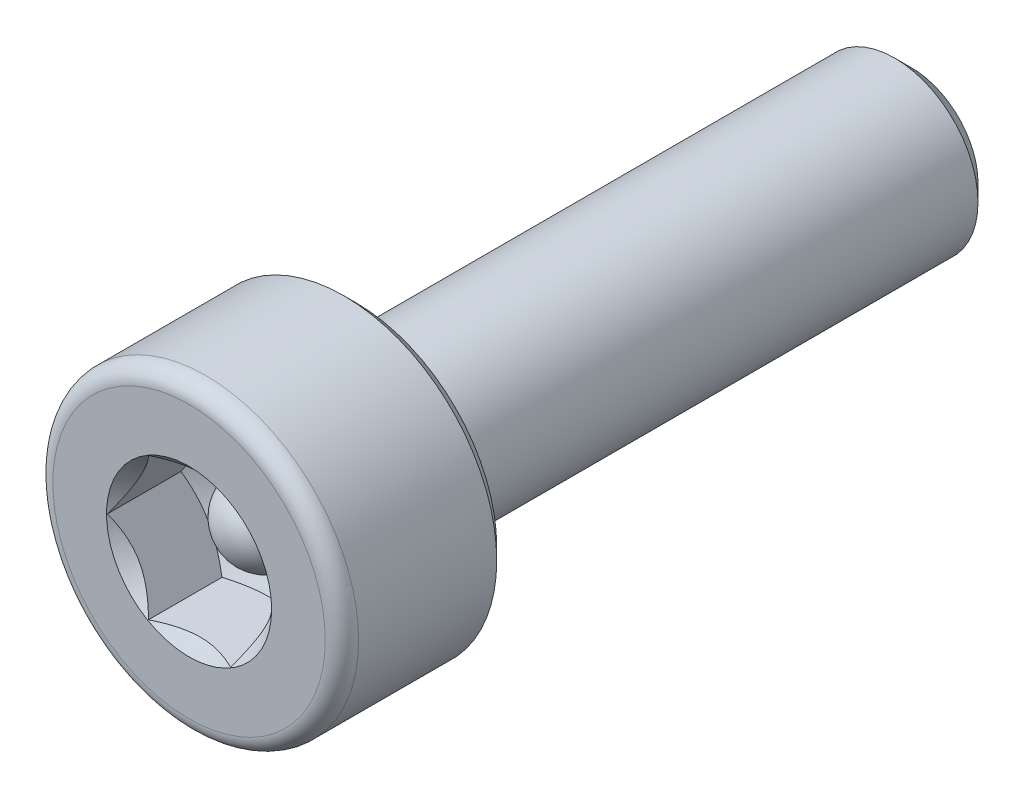
ISO-10303-21;
HEADER;
FILE_DESCRIPTION(('STEP AP214'),'2;1');
FILE_NAME('part.step','',(''),(''),'','','');
FILE_SCHEMA(('AUTOMOTIVE_DESIGN { 1 0 10303 214 1 1 1 1 }'));
ENDSEC;
DATA;
#1=APPLICATION_CONTEXT('core data for automotive mechanical design processes');
#2=APPLICATION_PROTOCOL_DEFINITION('international standard','automotive_design',2000,#1);
#3=PRODUCT_CONTEXT('',#1,'mechanical');
#4=PRODUCT('Part','Part','',(#3));
#5=PRODUCT_RELATED_PRODUCT_CATEGORY('part','',(#4));
#6=PRODUCT_DEFINITION_FORMATION('','',#4);
#7=PRODUCT_DEFINITION_CONTEXT('part definition',#1,'design');
#8=PRODUCT_DEFINITION('design','',#6,#7);
#9=PRODUCT_DEFINITION_SHAPE('','',#8);
#10=(LENGTH_UNIT() NAMED_UNIT(*) SI_UNIT(.MILLI.,.METRE.));
#11=(NAMED_UNIT(*) PLANE_ANGLE_UNIT() SI_UNIT($,.RADIAN.));
#12=(NAMED_UNIT(*) SI_UNIT($,.STERADIAN.) SOLID_ANGLE_UNIT());
#13=UNCERTAINTY_MEASURE_WITH_UNIT(LENGTH_MEASURE(1.E-05),#10,'distance_accuracy_value','');
#14=(GEOMETRIC_REPRESENTATION_CONTEXT(3) GLOBAL_UNCERTAINTY_ASSIGNED_CONTEXT((#13)) GLOBAL_UNIT_ASSIGNED_CONTEXT((#10,
#11,#12)) REPRESENTATION_CONTEXT('',''));
#15=CARTESIAN_POINT('',(0.,0.,0.));
#16=DIRECTION('',(0.,0.,1.));
#17=DIRECTION('',(1.,0.,0.));
#18=AXIS2_PLACEMENT_3D('',#15,#16,#17);
#19=CARTESIAN_POINT('',(0.,0.,1.615850938766));
#20=DIRECTION('',(1.,0.,0.));
#21=DIRECTION('',(0.,-1.,0.));
#22=AXIS2_PLACEMENT_3D('',#19,#20,#21);
#23=SPHERICAL_SURFACE('',#22,0.739008344563);
#24=CARTESIAN_POINT('',(0.739008344562999,0.,1.615850938766));
#25=VERTEX_POINT('',#24);
#26=VERTEX_LOOP('',#25);
#27=FACE_BOUND('',#26,.T.);
#28=CARTESIAN_POINT('',(-0.739008344563001,0.,1.615850938766));
#29=VERTEX_POINT('',#28);
#30=VERTEX_LOOP('',#29);
#31=FACE_BOUND('',#30,.T.);
#32=ADVANCED_FACE('P0_F20',(#27,#31),#23,.T.);
#33=CLOSED_SHELL('',(#32));
#34=MANIFOLD_SOLID_BREP('P0_B1',#33);
#35=CARTESIAN_POINT('',(0.,0.,-0.1));
#36=DIRECTION('',(0.,0.,-1.));
#37=DIRECTION('',(-1.,0.,0.));
#38=AXIS2_PLACEMENT_3D('',#35,#36,#37);
#39=CYLINDRICAL_SURFACE('',#38,1.5);
#40=CARTESIAN_POINT('',(0.,0.,-9.693282669493));
#41=DIRECTION('',(0.,0.,-1.));
#42=DIRECTION('',(-1.,0.,0.));
#43=AXIS2_PLACEMENT_3D('',#40,#41,#42);
#44=CIRCLE('',#43,1.5);
#45=CARTESIAN_POINT('',(-1.5,0.,-9.693282669493));
#46=VERTEX_POINT('',#45);
#47=EDGE_CURVE('P1_E38',#46,#46,#44,.F.);
#48=ORIENTED_EDGE('',*,*,#47,.T.);
#49=EDGE_LOOP('',(#48));
#50=FACE_BOUND('',#49,.T.);
#51=CARTESIAN_POINT('',(0.,0.,-0.1));
#52=DIRECTION('',(0.,0.,-1.));
#53=DIRECTION('',(-1.,0.,0.));
#54=AXIS2_PLACEMENT_3D('',#51,#52,#53);
#55=CIRCLE('',#54,1.5);
#56=CARTESIAN_POINT('',(-1.5,0.,-0.1));
#57=VERTEX_POINT('',#56);
#58=EDGE_CURVE('P1_E13',#57,#57,#55,.T.);
#59=ORIENTED_EDGE('',*,*,#58,.T.);
#60=EDGE_LOOP('',(#59));
#61=FACE_BOUND('',#60,.T.);
#62=ADVANCED_FACE('P1_F25',(#50,#61),#39,.T.);
#63=CARTESIAN_POINT('',(0.,0.,-0.1));
#64=DIRECTION('',(0.,0.,-1.));
#65=DIRECTION('',(1.,0.,0.));
#66=AXIS2_PLACEMENT_3D('',#63,#64,#65);
#67=TOROIDAL_SURFACE('',#66,1.6,0.1);
#68=ORIENTED_EDGE('',*,*,#58,.F.);
#69=EDGE_LOOP('',(#68));
#70=FACE_BOUND('',#69,.T.);
#71=CARTESIAN_POINT('',(0.,0.,0.));
#72=DIRECTION('',(0.,0.,-1.));
#73=DIRECTION('',(1.,0.,0.));
#74=AXIS2_PLACEMENT_3D('',#71,#72,#73);
#75=CIRCLE('',#74,1.6);
#76=CARTESIAN_POINT('',(1.6,0.,0.));
#77=VERTEX_POINT('',#76);
#78=EDGE_CURVE('P1_E131',#77,#77,#75,.F.);
#79=ORIENTED_EDGE('',*,*,#78,.F.);
#80=EDGE_LOOP('',(#79));
#81=FACE_BOUND('',#80,.T.);
#82=ADVANCED_FACE('P1_F303',(#70,#81),#67,.F.);
#83=CARTESIAN_POINT('',(0.,0.,-9.69328266961611));
#84=DIRECTION('',(0.,0.,1.));
#85=DIRECTION('',(1.,0.,0.));
#86=AXIS2_PLACEMENT_3D('',#83,#84,#85);
#87=CONICAL_SURFACE('',#86,1.49999999990769,0.785398163397448);
#88=CARTESIAN_POINT('',(0.,0.,-9.99999999999091));
#89=DIRECTION('',(0.,0.,1.));
#90=DIRECTION('',(1.,0.,0.));
#91=AXIS2_PLACEMENT_3D('',#88,#89,#90);
#92=CIRCLE('',#91,1.19328266953289);
#93=CARTESIAN_POINT('',(1.19328266953289,0.,-9.99999999999091));
#94=VERTEX_POINT('',#93);
#95=EDGE_CURVE('P1_E128',#94,#94,#92,.T.);
#96=ORIENTED_EDGE('',*,*,#95,.T.);
#97=EDGE_LOOP('',(#96));
#98=FACE_BOUND('',#97,.T.);
#99=ORIENTED_EDGE('',*,*,#47,.F.);
#100=EDGE_LOOP('',(#99));
#101=FACE_BOUND('',#100,.T.);
#102=ADVANCED_FACE('P1_F294',(#98,#101),#87,.T.);
#103=CARTESIAN_POINT('',(0.,0.,0.));
#104=DIRECTION('',(0.,0.,1.));
#105=DIRECTION('',(1.,0.,0.));
#106=AXIS2_PLACEMENT_3D('',#103,#104,#105);
#107=PLANE('',#106);
#108=ORIENTED_EDGE('',*,*,#78,.T.);
#109=EDGE_LOOP('',(#108));
#110=FACE_BOUND('',#109,.T.);
#111=CARTESIAN_POINT('',(0.,0.,0.));
#112=DIRECTION('',(0.,0.,1.));
#113=DIRECTION('',(1.,0.,0.));
#114=AXIS2_PLACEMENT_3D('',#111,#112,#113);
#115=CIRCLE('',#114,2.5349999999662);
#116=CARTESIAN_POINT('',(2.5349999999662,0.,0.));
#117=VERTEX_POINT('',#116);
#118=EDGE_CURVE('P1_E132',#117,#117,#115,.T.);
#119=ORIENTED_EDGE('',*,*,#118,.F.);
#120=EDGE_LOOP('',(#119));
#121=FACE_BOUND('',#120,.T.);
#122=ADVANCED_FACE('P1_F285',(#110,#121),#107,.F.);
#123=CARTESIAN_POINT('',(0.,0.,-10.));
#124=DIRECTION('',(0.,0.,1.));
#125=DIRECTION('',(1.,0.,0.));
#126=AXIS2_PLACEMENT_3D('',#123,#124,#125);
#127=PLANE('',#126);
#128=ORIENTED_EDGE('',*,*,#95,.F.);
#129=EDGE_LOOP('',(#128));
#130=FACE_BOUND('',#129,.T.);
#131=ADVANCED_FACE('P1_F276',(#130),#127,.F.);
#132=CARTESIAN_POINT('',(0.,0.,0.215000000025612));
#133=DIRECTION('',(0.,0.,1.));
#134=DIRECTION('',(1.,0.,0.));
#135=AXIS2_PLACEMENT_3D('',#132,#133,#134);
#136=CONICAL_SURFACE('',#135,2.74999999993497,0.785398163265254);
#137=ORIENTED_EDGE('',*,*,#118,.T.);
#138=EDGE_LOOP('',(#137));
#139=FACE_BOUND('',#138,.T.);
#140=CARTESIAN_POINT('',(0.,0.,0.215000000025612));
#141=DIRECTION('',(0.,0.,1.));
#142=DIRECTION('',(1.,0.,0.));
#143=AXIS2_PLACEMENT_3D('',#140,#141,#142);
#144=CIRCLE('',#143,2.74999999993497);
#145=CARTESIAN_POINT('',(2.74999999993497,0.,0.215000000025612));
#146=VERTEX_POINT('',#145);
#147=EDGE_CURVE('P1_E135',#146,#146,#144,.F.);
#148=ORIENTED_EDGE('',*,*,#147,.T.);
#149=EDGE_LOOP('',(#148));
#150=FACE_BOUND('',#149,.T.);
#151=ADVANCED_FACE('P1_F267',(#139,#150),#136,.T.);
#152=CARTESIAN_POINT('',(0.,0.,2.7));
#153=DIRECTION('',(0.,0.,-1.));
#154=DIRECTION('',(-1.,0.,0.));
#155=AXIS2_PLACEMENT_3D('',#152,#153,#154);
#156=CYLINDRICAL_SURFACE('',#155,2.75);
#157=ORIENTED_EDGE('',*,*,#147,.F.);
#158=EDGE_LOOP('',(#157));
#159=FACE_BOUND('',#158,.T.);
#160=CARTESIAN_POINT('',(0.,0.,2.7));
#161=DIRECTION('',(0.,0.,-1.));
#162=DIRECTION('',(-1.,0.,0.));
#163=AXIS2_PLACEMENT_3D('',#160,#161,#162);
#164=CIRCLE('',#163,2.75);
#165=CARTESIAN_POINT('',(-2.75,0.,2.7));
#166=VERTEX_POINT('',#165);
#167=EDGE_CURVE('P1_E442',#166,#166,#164,.T.);
#168=ORIENTED_EDGE('',*,*,#167,.T.);
#169=EDGE_LOOP('',(#168));
#170=FACE_BOUND('',#169,.T.);
#171=ADVANCED_FACE('P1_F259',(#159,#170),#156,.T.);
#172=CARTESIAN_POINT('',(0.,0.,2.7));
#173=DIRECTION('',(0.,0.,-1.));
#174=DIRECTION('',(1.,0.,0.));
#175=AXIS2_PLACEMENT_3D('',#172,#173,#174);
#176=TOROIDAL_SURFACE('',#175,2.45,0.3);
#177=ORIENTED_EDGE('',*,*,#167,.F.);
#178=EDGE_LOOP('',(#177));
#179=FACE_BOUND('',#178,.T.);
#180=CARTESIAN_POINT('',(0.,0.,3.));
#181=DIRECTION('',(0.,0.,-1.));
#182=DIRECTION('',(1.,0.,0.));
#183=AXIS2_PLACEMENT_3D('',#180,#181,#182);
#184=CIRCLE('',#183,2.45);
#185=CARTESIAN_POINT('',(2.45,0.,3.));
#186=VERTEX_POINT('',#185);
#187=EDGE_CURVE('P1_E139',#186,#186,#184,.F.);
#188=ORIENTED_EDGE('',*,*,#187,.F.);
#189=EDGE_LOOP('',(#188));
#190=FACE_BOUND('',#189,.T.);
#191=ADVANCED_FACE('P1_F251',(#179,#190),#176,.T.);
#192=CARTESIAN_POINT('',(0.,0.,3.));
#193=DIRECTION('',(0.,0.,1.));
#194=DIRECTION('',(1.,0.,0.));
#195=AXIS2_PLACEMENT_3D('',#192,#193,#194);
#196=PLANE('',#195);
#197=ORIENTED_EDGE('',*,*,#187,.T.);
#198=EDGE_LOOP('',(#197));
#199=FACE_BOUND('',#198,.T.);
#200=CARTESIAN_POINT('',(0.,0.,2.99999999998591));
#201=DIRECTION('',(0.,0.,1.));
#202=DIRECTION('',(1.,0.,0.));
#203=AXIS2_PLACEMENT_3D('',#200,#201,#202);
#204=CIRCLE('',#203,1.4854439087344);
#205=CARTESIAN_POINT('',(1.4854439087344,0.,2.99999999998591));
#206=VERTEX_POINT('',#205);
#207=EDGE_CURVE('P1_E136',#206,#206,#204,.F.);
#208=ORIENTED_EDGE('',*,*,#207,.T.);
#209=EDGE_LOOP('',(#208));
#210=FACE_BOUND('',#209,.T.);
#211=ADVANCED_FACE('P1_F158',(#199,#210),#196,.T.);
#212=CARTESIAN_POINT('',(0.,0.,2.99999999998591));
#213=DIRECTION('',(0.,0.,1.));
#214=DIRECTION('',(1.,0.,0.));
#215=AXIS2_PLACEMENT_3D('',#212,#213,#214);
#216=CONICAL_SURFACE('',#215,1.4854439087344,0.785398163397448);
#217=ORIENTED_EDGE('',*,*,#207,.F.);
#218=EDGE_LOOP('',(#217));
#219=FACE_BOUND('',#218,.T.);
#220=CARTESIAN_POINT('',(-0.73900833039765,1.28000002453511,2.99257279454244));
#221=CARTESIAN_POINT('',(-0.764408407762743,1.23600580002261,2.96719708967992));
#222=CARTESIAN_POINT('',(-0.790233176713148,1.1912759881068,2.94331199094595));
#223=CARTESIAN_POINT('',(-0.842892530835465,1.10006731127323,2.89957939484165));
#224=CARTESIAN_POINT('',(-0.869732121178957,1.05357977714399,2.87975622232529));
#225=CARTESIAN_POINT('',(-0.923852835173947,0.959839950762813,2.84579898979231));
#226=CARTESIAN_POINT('',(-0.951120183396314,0.912611518254026,2.83157960268337));
#227=CARTESIAN_POINT('',(-1.0062550176399,0.817115184077292,2.80967194523321));
#228=CARTESIAN_POINT('',(-1.03412082054732,0.768850197647961,2.80196732772804));
#229=CARTESIAN_POINT('',(-1.08215006859365,0.68566109978243,2.79501535623299));
#230=CARTESIAN_POINT('',(-1.10225153047865,0.650844346491229,2.79398660559318));
#231=CARTESIAN_POINT('',(-1.14241907185677,0.581272124009232,2.795722599224));
#232=CARTESIAN_POINT('',(-1.16248514255375,0.546516670053808,2.79848818146684));
#233=CARTESIAN_POINT('',(-1.20242355510745,0.477341310337187,2.80765297004438));
#234=CARTESIAN_POINT('',(-1.22229569931528,0.442921746913914,2.814055555235));
#235=CARTESIAN_POINT('',(-1.26170819927281,0.374657294534199,2.83014952360517));
#236=CARTESIAN_POINT('',(-1.28124840886902,0.340812658723032,2.83984231799677));
#237=CARTESIAN_POINT('',(-1.3312711614295,0.254170709753885,2.86859538704998));
#238=CARTESIAN_POINT('',(-1.3614389218517,0.201918615952089,2.88981369969133));
#239=CARTESIAN_POINT('',(-1.42059417461341,0.0994587126342793,2.93760802816772));
#240=CARTESIAN_POINT('',(-1.44958514902605,0.0492448719906819,2.9641666033907));
#241=CARTESIAN_POINT('',(-1.47801665262797,6.32166031965428E-08,2.99257274387948));
#242=B_SPLINE_CURVE_WITH_KNOTS('',3,(#220,#221,#222,#223,#224,#225,#226,#227,#228,#229,#230,
#231,#232,#233,#234,#235,#236,#237,#238,#239,#240,#241),.UNSPECIFIED.,.F.,.F.,(4,2,2,2,2,2,2,2,
2,2,4),(0.,0.170474178045342,0.341941186072123,0.510685878115575,0.679005880861946,
0.799483496257405,0.919987723220982,1.04060408478871,1.16127224573515,1.35282268707442,
1.54375742347497),.UNSPECIFIED.);
#243=CARTESIAN_POINT('',(-0.739008307823175,1.28,2.99257276200718));
#244=VERTEX_POINT('',#243);
#245=CARTESIAN_POINT('',(-1.47801667075188,3.18241214037053E-08,2.99257276200339));
#246=VERTEX_POINT('',#245);
#247=EDGE_CURVE('P1_E47',#244,#246,#242,.T.);
#248=ORIENTED_EDGE('',*,*,#247,.F.);
#249=CARTESIAN_POINT('',(0.739008272408615,1.28000000611594,2.99257274094721));
#250=CARTESIAN_POINT('',(0.688208122719239,1.28000000220067,2.96719704334762));
#251=CARTESIAN_POINT('',(0.636558590484335,1.28000000059091,2.94331195077126));
#252=CARTESIAN_POINT('',(0.531239894532555,1.27999999940565,2.89957936559876));
#253=CARTESIAN_POINT('',(0.477560720480201,1.27999999984207,2.87975619784138));
#254=CARTESIAN_POINT('',(0.369319305960669,1.28000000015542,2.8457989740032));
#255=CARTESIAN_POINT('',(0.314784616340693,1.28000000004114,2.83157959085406));
#256=CARTESIAN_POINT('',(0.20451496200542,1.27999999995897,2.80967193977415));
#257=CARTESIAN_POINT('',(0.148783363515357,1.27999999999072,2.80196732468796));
#258=CARTESIAN_POINT('',(0.0527248750781001,1.28000000000665,2.7950153553539));
#259=CARTESIAN_POINT('',(0.0125219515476335,1.28000000000178,2.79398660539415));
#260=CARTESIAN_POINT('',(-0.0678131306698069,1.27999999999822,2.79572260032543));
#261=CARTESIAN_POINT('',(-0.107945271764465,1.27999999999952,2.79848818318913));
#262=CARTESIAN_POINT('',(-0.187822096259195,1.28000000000048,2.80765297292113));
#263=CARTESIAN_POINT('',(-0.22756638436111,1.28000000000013,2.8140555586481));
#264=CARTESIAN_POINT('',(-0.306391383623088,1.27999999999987,2.83014952798809));
#265=CARTESIAN_POINT('',(-0.34547180247616,1.27999999999996,2.83984232281309));
#266=CARTESIAN_POINT('',(-0.445517304080995,1.28000000000007,2.86859539209756));
#267=CARTESIAN_POINT('',(-0.505852821834524,1.28000000000004,2.88981370415139));
#268=CARTESIAN_POINT('',(-0.62416332131743,1.27999999999997,2.93760803081389));
#269=CARTESIAN_POINT('',(-0.682145267195324,1.27999999999993,2.96416660480513));
#270=CARTESIAN_POINT('',(-0.739008271582371,1.28,2.99257274388677));
#271=B_SPLINE_CURVE_WITH_KNOTS('',3,(#249,#250,#251,#252,#253,#254,#255,#256,#257,#258,#259,
#260,#261,#262,#263,#264,#265,#266,#267,#268,#269,#270),.UNSPECIFIED.,.F.,.F.,(4,2,2,2,2,2,2,2,
2,2,4),(0.,0.17047415492173,0.341941139416434,0.510685808711829,0.679005788888608,
0.799483403509875,0.919987629713267,1.04060399061424,1.16127215089304,1.35282258295895,
1.54375730985654),.UNSPECIFIED.);
#272=CARTESIAN_POINT('',(0.739008337482733,1.28000001226243,2.99257278745654));
#273=VERTEX_POINT('',#272);
#274=EDGE_CURVE('P1_E173',#273,#244,#271,.T.);
#275=ORIENTED_EDGE('',*,*,#274,.F.);
#276=CARTESIAN_POINT('',(1.47801667853174,1.8348056452837E-08,2.99257276978325));
#277=CARTESIAN_POINT('',(1.45261660259499,0.0439942403865975,2.96719706761263));
#278=CARTESIAN_POINT('',(1.42679183511048,0.08872404976341,2.94331197153223));
#279=CARTESIAN_POINT('',(1.37413248406308,0.179932721271057,2.89957938050909));
#280=CARTESIAN_POINT('',(1.34729289533023,0.226420252610582,2.87975621041389));
#281=CARTESIAN_POINT('',(1.29317218473374,0.320160073105397,2.84579898225534));
#282=CARTESIAN_POINT('',(1.26590483829921,0.367388502517554,2.83157959709393));
#283=CARTESIAN_POINT('',(1.21077000774575,0.462884830302806,2.80967194275167));
#284=CARTESIAN_POINT('',(1.18290420673992,0.511149813438469,2.80196732641221));
#285=CARTESIAN_POINT('',(1.13487496071501,0.594338907802802,2.7950153558772));
#286=CARTESIAN_POINT('',(1.11477349892741,0.629155660925311,2.79398660551534));
#287=CARTESIAN_POINT('',(1.07460595775605,0.698727883049189,2.79572259966083));
#288=CARTESIAN_POINT('',(1.05453988716844,0.733483336815178,2.79848818214051));
#289=CARTESIAN_POINT('',(1.01460147479739,0.802658696215434,2.80765297114743));
#290=CARTESIAN_POINT('',(0.994729330663319,0.83707825951096,2.81405555653851));
#291=CARTESIAN_POINT('',(0.95531683085651,0.905342711629617,2.83014952526765));
#292=CARTESIAN_POINT('',(0.935776621337286,0.939187347307438,2.83984231981792));
#293=CARTESIAN_POINT('',(0.885753860349397,1.02582931087329,2.86859539417932));
#294=CARTESIAN_POINT('',(0.855586091716678,1.07808141889612,2.88981371394575));
#295=CARTESIAN_POINT('',(0.79643082320749,1.18054134948936,2.93760805912835));
#296=CARTESIAN_POINT('',(0.767439841253866,1.23075520319432,2.9641666439137));
#297=CARTESIAN_POINT('',(0.739008330402467,1.28000002452487,2.99257279453598));
#298=B_SPLINE_CURVE_WITH_KNOTS('',3,(#276,#277,#278,#279,#280,#281,#282,#283,#284,#285,#286,
#287,#288,#289,#290,#291,#292,#293,#294,#295,#296,#297),.UNSPECIFIED.,.F.,.F.,(4,2,2,2,2,2,2,2,
2,2,4),(0.,0.170474166745542,0.341941163208504,0.510685843446508,0.679005834505185,
0.799483449295664,0.91998767565746,1.040604036887,1.16127219750169,1.35282269216248,
1.54375748133644),.UNSPECIFIED.);
#299=CARTESIAN_POINT('',(1.47801667853205,-4.26931163012624E-13,2.99257276978356));
#300=VERTEX_POINT('',#299);
#301=EDGE_CURVE('P1_E179',#300,#273,#298,.T.);
#302=ORIENTED_EDGE('',*,*,#301,.F.);
#303=CARTESIAN_POINT('',(0.739008330397649,-1.28000002453511,2.99257279454244));
#304=CARTESIAN_POINT('',(0.764408407784721,-1.23600579998454,2.96719708965798));
#305=CARTESIAN_POINT('',(0.790233176757962,-1.19127598802918,2.94331199090453));
#306=CARTESIAN_POINT('',(0.842892530927419,-1.10006731111396,2.89957939476955));
#307=CARTESIAN_POINT('',(0.869732121295217,-1.05357977694262,2.87975622224202));
#308=CARTESIAN_POINT('',(0.923852835292992,-0.959839950556622,2.84579898972774));
#309=CARTESIAN_POINT('',(0.951120183492341,-0.912611518087701,2.83157960263935));
#310=CARTESIAN_POINT('',(1.00625501768864,-0.817115183992871,2.80967194521967));
#311=CARTESIAN_POINT('',(1.0341208205718,-0.768850197605565,2.80196732772449));
#312=CARTESIAN_POINT('',(1.08215006858505,-0.685661099797333,2.79501535623424));
#313=CARTESIAN_POINT('',(1.10225153046139,-0.650844346521124,2.79398660559405));
#314=CARTESIAN_POINT('',(1.14241907182218,-0.581272124069146,2.79572259922089));
#315=CARTESIAN_POINT('',(1.16248514251048,-0.546516670128749,2.79848818146012));
#316=CARTESIAN_POINT('',(1.20242355506417,-0.477341310412151,2.80765297003124));
#317=CARTESIAN_POINT('',(1.22229569928048,-0.442921746974186,2.81405555522214));
#318=CARTESIAN_POINT('',(1.26170819925536,-0.374657294564425,2.8301495235967));
#319=CARTESIAN_POINT('',(1.28124840886042,-0.340812658737923,2.83984231799251));
#320=CARTESIAN_POINT('',(1.33127116608195,-0.254170701695607,2.86859538972314));
#321=CARTESIAN_POINT('',(1.36143893099818,-0.201918600109919,2.8898137061194));
#322=CARTESIAN_POINT('',(1.42059419239467,-0.0994586818362385,2.9376080434876));
#323=CARTESIAN_POINT('',(1.44958517094973,-0.0492448340177656,2.96416662383977));
#324=CARTESIAN_POINT('',(1.47801667853235,-1.83489103127095E-08,2.99257276978386));
#325=B_SPLINE_CURVE_WITH_KNOTS('',3,(#303,#304,#305,#306,#307,#308,#309,#310,#311,#312,#313,
#314,#315,#316,#317,#318,#319,#320,#321,#322,#323,#324),.UNSPECIFIED.,.F.,.F.,(4,2,2,2,2,2,2,2,
2,2,4),(0.,0.170474178193379,0.341941186367865,0.510685878262844,0.679005880862118,
0.7994834962059,0.919987723117027,1.04060408473501,1.16127224573534,1.35282271611338,
1.54375748134627),.UNSPECIFIED.);
#326=CARTESIAN_POINT('',(0.739008307823175,-1.28,2.99257276200718));
#327=VERTEX_POINT('',#326);
#328=EDGE_CURVE('P1_E103',#327,#300,#325,.T.);
#329=ORIENTED_EDGE('',*,*,#328,.F.);
#330=CARTESIAN_POINT('',(-0.739008372896817,-1.28,2.992572794544));
#331=CARTESIAN_POINT('',(-0.688208218166412,-1.28,2.96719708968126));
#332=CARTESIAN_POINT('',(-0.636558680265378,-1.28,2.94331199094707));
#333=CARTESIAN_POINT('',(-0.53123997202027,-1.28,2.89957939484236));
#334=CARTESIAN_POINT('',(-0.477560791333037,-1.28,2.87975622232579));
#335=CARTESIAN_POINT('',(-0.369319363342573,-1.28,2.84579898979248));
#336=CARTESIAN_POINT('',(-0.314784666897608,-1.28,2.83157960268339));
#337=CARTESIAN_POINT('',(-0.204514998409948,-1.28,2.809671945233));
#338=CARTESIAN_POINT('',(-0.148783392594856,-1.28,2.80196732772774));
#339=CARTESIAN_POINT('',(-0.0527248965019614,-1.28,2.79501535623261));
#340=CARTESIAN_POINT('',(-0.0125219727319932,-1.28,2.79398660559279));
#341=CARTESIAN_POINT('',(0.0678131100242127,-1.28,2.79572259922356));
#342=CARTESIAN_POINT('',(0.107945251418159,-1.28,2.79848818146638));
#343=CARTESIAN_POINT('',(0.187822076525533,-1.28,2.80765297004388));
#344=CARTESIAN_POINT('',(0.227566364941178,-1.28,2.81405555523448));
#345=CARTESIAN_POINT('',(0.306391364856226,-1.28,2.83014952360461));
#346=CARTESIAN_POINT('',(0.345471784048643,-1.28,2.8398423179962));
#347=CARTESIAN_POINT('',(0.445517289172432,-1.28,2.8685953870502));
#348=CARTESIAN_POINT('',(0.505852810019584,-1.28,2.88981369969269));
#349=CARTESIAN_POINT('',(0.624163315548282,-1.28,2.93760802817178));
#350=CARTESIAN_POINT('',(0.682145264376096,-1.28,2.96416660339633));
#351=CARTESIAN_POINT('',(0.739008271582371,-1.28,2.99257274388677));
#352=B_SPLINE_CURVE_WITH_KNOTS('',3,(#330,#331,#332,#333,#334,#335,#336,#337,#338,#339,#340,
#341,#342,#343,#344,#345,#346,#347,#348,#349,#350,#351),.UNSPECIFIED.,.F.,.F.,(4,2,2,2,2,2,2,2,
2,2,4),(0.,0.170474178046279,0.34194118607402,0.510685878118316,0.679005880865522,
0.799483496260969,0.919987723224533,1.04060408479228,1.16127224573873,1.35282268708692,
1.54375742349635),.UNSPECIFIED.);
#353=CARTESIAN_POINT('',(-0.739008362932853,-1.27999996818058,2.99257276200559));
#354=VERTEX_POINT('',#353);
#355=EDGE_CURVE('P1_E101',#354,#327,#352,.T.);
#356=ORIENTED_EDGE('',*,*,#355,.F.);
#357=CARTESIAN_POINT('',(-1.47801670328417,2.45243962858424E-08,2.99257279453568));
#358=CARTESIAN_POINT('',(-1.45261662591942,-0.0439941999874959,2.9671970896738));
#359=CARTESIAN_POINT('',(-1.42679185696938,-0.088724011902678,2.94331199094046));
#360=CARTESIAN_POINT('',(-1.37413250284782,-0.179932688734942,2.89957939483736));
#361=CARTESIAN_POINT('',(-1.34729291250472,-0.2264202228635,2.87975622232157));
#362=CARTESIAN_POINT('',(-1.29317219851055,-0.320160049243261,2.84579898978961));
#363=CARTESIAN_POINT('',(-1.2659048502886,-0.367388481751313,2.83157960268112));
#364=CARTESIAN_POINT('',(-1.21077001604589,-0.462884815926531,2.80967194523168));
#365=CARTESIAN_POINT('',(-1.18290421313892,-0.51114980235508,2.80196732772679));
#366=CARTESIAN_POINT('',(-1.13487496509308,-0.594338900219759,2.79501535623196));
#367=CARTESIAN_POINT('',(-1.11477350320812,-0.6291556535109,2.79398660559222));
#368=CARTESIAN_POINT('',(-1.07460596183007,-0.69872787599277,2.79572259922315));
#369=CARTESIAN_POINT('',(-1.05453989113313,-0.733483329948128,2.79848818146604));
#370=CARTESIAN_POINT('',(-1.0146014785795,-0.802658689664624,2.80765297004368));
#371=CARTESIAN_POINT('',(-0.994729334371709,-0.83707825308784,2.81405555523434));
#372=CARTESIAN_POINT('',(-0.955316834414246,-0.905342705467438,2.83014952360458));
#373=CARTESIAN_POINT('',(-0.935776624818068,-0.939187341278546,2.83984231799621));
#374=CARTESIAN_POINT('',(-0.885753872256689,-1.02582929024926,2.86859538705004));
#375=CARTESIAN_POINT('',(-0.855586111833582,-1.07808138405262,2.88981369969221));
#376=CARTESIAN_POINT('',(-0.796430859070142,-1.18054128737342,2.9376080281705));
#377=CARTESIAN_POINT('',(-0.767439884656676,-1.23075512801845,2.96416660339457));
#378=CARTESIAN_POINT('',(-0.739008381053962,-1.2799999367939,2.99257274388449));
#379=B_SPLINE_CURVE_WITH_KNOTS('',3,(#357,#358,#359,#360,#361,#362,#363,#364,#365,#366,#367,
#368,#369,#370,#371,#372,#373,#374,#375,#376,#377,#378),.UNSPECIFIED.,.F.,.F.,(4,2,2,2,2,2,2,2,
2,2,4),(0.,0.170474178042595,0.34194118606657,0.510685878107226,0.679005880850828,
0.79948349624607,0.919987723209431,1.04060408477699,1.16127224572325,1.35282268706841,
1.54375742347479),.UNSPECIFIED.);
#380=EDGE_CURVE('P1_E99',#246,#354,#379,.T.);
#381=ORIENTED_EDGE('',*,*,#380,.F.);
#382=EDGE_LOOP('',(#248,#275,#302,#329,#356,#381));
#383=FACE_BOUND('',#382,.T.);
#384=ADVANCED_FACE('P1_F154',(#219,#383),#216,.F.);
#385=CARTESIAN_POINT('',(-1.478016689125,0.,4.));
#386=DIRECTION('',(-0.866025403784329,-0.50000000000019,0.));
#387=DIRECTION('',(0.50000000000019,-0.866025403784329,0.));
#388=AXIS2_PLACEMENT_3D('',#385,#386,#387);
#389=PLANE('',#388);
#390=CARTESIAN_POINT('',(-1.47801668912927,7.40140874405819E-12,1.66821187995555));
#391=CARTESIAN_POINT('',(-1.44543422538176,-0.0564344826390374,1.64869441099508));
#392=CARTESIAN_POINT('',(-1.41254915183333,-0.113393100835532,1.63093697134104));
#393=CARTESIAN_POINT('',(-1.3461645207857,-0.22837465465167,1.59995007271958));
#394=CARTESIAN_POINT('',(-1.31266357555924,-0.286399993885459,1.58673263572));
#395=CARTESIAN_POINT('',(-1.24610867453935,-0.401676463944573,1.56622424110573));
#396=CARTESIAN_POINT('',(-1.2130665937308,-0.458907026692746,1.55878475304556));
#397=CARTESIAN_POINT('',(-1.14681860473037,-0.573651909540697,1.5499903879319));
#398=CARTESIAN_POINT('',(-1.1136129775487,-0.631165742916505,1.54862731922389));
#399=CARTESIAN_POINT('',(-1.05184366410041,-0.738153332157539,1.5518632069523));
#400=CARTESIAN_POINT('',(-1.02326863836162,-0.787646728564677,1.55566923535867));
#401=CARTESIAN_POINT('',(-0.966319631082127,-0.886285302613328,1.56759997183644));
#402=CARTESIAN_POINT('',(-0.937945879656263,-0.935430081684229,1.57572900305517));
#403=CARTESIAN_POINT('',(-0.88087388118021,-1.0342816827342,1.59600087659475));
#404=CARTESIAN_POINT('',(-0.852183896751241,-1.08397419343351,1.60823433680883));
#405=CARTESIAN_POINT('',(-0.795260914250543,-1.18256769124302,1.6359541883402));
#406=CARTESIAN_POINT('',(-0.767027075163526,-1.23147013503443,1.6514336171397));
#407=CARTESIAN_POINT('',(-0.739008344558036,-1.2800000000067,1.66821187995533));
#408=B_SPLINE_CURVE_WITH_KNOTS('',3,(#390,#391,#392,#393,#394,#395,#396,#397,#398,#399,#400,
#401,#402,#403,#404,#405,#406,#407),.UNSPECIFIED.,.F.,.F.,(4,2,2,2,2,2,2,2,4),(0.,
0.204164271419992,0.408865077483371,0.608111505081253,0.807089246080721,0.978746004979672,
1.15057475007757,1.32647851521597,1.5020087617587),.UNSPECIFIED.);
#409=CARTESIAN_POINT('',(-1.47801668912744,-3.27435413642058E-12,1.66821187995445));
#410=VERTEX_POINT('',#409);
#411=CARTESIAN_POINT('',(-0.739008344564367,-1.28000000000335,1.66821187995549));
#412=VERTEX_POINT('',#411);
#413=EDGE_CURVE('P1_E80',#410,#412,#408,.T.);
#414=ORIENTED_EDGE('',*,*,#413,.F.);
#415=DIRECTION('',(0.,0.,1.));
#416=VECTOR('',#415,1.);
#417=CARTESIAN_POINT('',(-1.478016689125,0.,4.));
#418=LINE('',#417,#416);
#419=EDGE_CURVE('P1_E88',#246,#410,#418,.F.);
#420=ORIENTED_EDGE('',*,*,#419,.F.);
#421=ORIENTED_EDGE('',*,*,#380,.T.);
#422=DIRECTION('',(0.,0.,1.));
#423=VECTOR('',#422,1.);
#424=CARTESIAN_POINT('',(-0.739008344562178,-1.27999999999953,4.));
#425=LINE('',#424,#423);
#426=EDGE_CURVE('P1_E87',#412,#354,#425,.T.);
#427=ORIENTED_EDGE('',*,*,#426,.F.);
#428=EDGE_LOOP('',(#414,#420,#421,#427));
#429=FACE_BOUND('',#428,.T.);
#430=ADVANCED_FACE('P1_F97',(#429),#389,.F.);
#431=CARTESIAN_POINT('',(-0.739008344563,1.28,4.));
#432=DIRECTION('',(-0.866025403784329,0.50000000000019,0.));
#433=DIRECTION('',(-0.50000000000019,-0.866025403784329,0.));
#434=AXIS2_PLACEMENT_3D('',#431,#432,#433);
#435=PLANE('',#434);
#436=CARTESIAN_POINT('',(-0.739008344558926,1.28000000000706,1.66821187995578));
#437=CARTESIAN_POINT('',(-0.771590808306453,1.2235655173606,1.64869441099533));
#438=CARTESIAN_POINT('',(-0.804475881854898,1.16660689916408,1.63093697134131));
#439=CARTESIAN_POINT('',(-0.870860512902544,1.0516253453479,1.59995007271991));
#440=CARTESIAN_POINT('',(-0.904361458129021,0.99360000611409,1.58673263572036));
#441=CARTESIAN_POINT('',(-0.970916359148938,0.878323536054935,1.56622424110616));
#442=CARTESIAN_POINT('',(-1.0039584399575,0.821092973306742,1.55878475304601));
#443=CARTESIAN_POINT('',(-1.07020642895795,0.706348090458752,1.54999038793243));
#444=CARTESIAN_POINT('',(-1.10341205613963,0.648834257082926,1.54862731922445));
#445=CARTESIAN_POINT('',(-1.16518136958789,0.541846667841935,1.55186320695292));
#446=CARTESIAN_POINT('',(-1.19375639532664,0.492353271434859,1.55566923535931));
#447=CARTESIAN_POINT('',(-1.25070540260607,0.39371469738633,1.56759997183711));
#448=CARTESIAN_POINT('',(-1.2790791540319,0.344569918315489,1.57572900305584));
#449=CARTESIAN_POINT('',(-1.33615115250788,0.245718317265647,1.59600087659542));
#450=CARTESIAN_POINT('',(-1.36484113693681,0.1960258065664,1.60823433680949));
#451=CARTESIAN_POINT('',(-1.42176411943744,0.0974323087570131,1.63595418834082));
#452=CARTESIAN_POINT('',(-1.44999795852442,0.0485298649656601,1.65143361714031));
#453=CARTESIAN_POINT('',(-1.47801668912988,-6.54871701998737E-12,1.66821187995591));
#454=B_SPLINE_CURVE_WITH_KNOTS('',3,(#436,#437,#438,#439,#440,#441,#442,#443,#444,#445,#446,
#447,#448,#449,#450,#451,#452,#453),.UNSPECIFIED.,.F.,.F.,(4,2,2,2,2,2,2,2,4),(0.,
0.204164271420047,0.408865077483478,0.608111505081418,0.807089246080946,0.978746004979692,
1.15057475007739,1.32647851521556,1.50200876175807),.UNSPECIFIED.);
#455=CARTESIAN_POINT('',(-0.739008344567075,1.28,1.66821187995456));
#456=VERTEX_POINT('',#455);
#457=EDGE_CURVE('P1_E84',#456,#410,#454,.T.);
#458=ORIENTED_EDGE('',*,*,#457,.F.);
#459=DIRECTION('',(0.,0.,1.));
#460=VECTOR('',#459,1.);
#461=CARTESIAN_POINT('',(-0.739008344563,1.28,4.));
#462=LINE('',#461,#460);
#463=EDGE_CURVE('P1_E112',#244,#456,#462,.F.);
#464=ORIENTED_EDGE('',*,*,#463,.F.);
#465=ORIENTED_EDGE('',*,*,#247,.T.);
#466=ORIENTED_EDGE('',*,*,#419,.T.);
#467=EDGE_LOOP('',(#458,#464,#465,#466));
#468=FACE_BOUND('',#467,.T.);
#469=ADVANCED_FACE('P1_F218',(#468),#435,.F.);
#470=CARTESIAN_POINT('',(0.739008344563,1.28,4.));
#471=DIRECTION('',(0.,1.,0.));
#472=DIRECTION('',(-1.,0.,0.));
#473=AXIS2_PLACEMENT_3D('',#470,#471,#472);
#474=PLANE('',#473);
#475=CARTESIAN_POINT('',(0.739008344570848,1.28,1.66821187995569));
#476=CARTESIAN_POINT('',(0.673843417075828,1.28,1.64869441099523));
#477=CARTESIAN_POINT('',(0.608073269978974,1.28,1.6309369713412));
#478=CARTESIAN_POINT('',(0.47530400788375,1.28,1.59995007271978));
#479=CARTESIAN_POINT('',(0.408302117430832,1.28,1.58673263572021));
#480=CARTESIAN_POINT('',(0.275192315391068,1.28,1.56622424110598));
#481=CARTESIAN_POINT('',(0.209108153773983,1.28,1.55878475304582));
#482=CARTESIAN_POINT('',(0.0766121757731466,1.28,1.5499903879322));
#483=CARTESIAN_POINT('',(0.0102009214098261,1.28,1.54862731922421));
#484=CARTESIAN_POINT('',(-0.113337705486716,1.28,1.55186320695265));
#485=CARTESIAN_POINT('',(-0.170487756964257,1.28,1.55566923535904));
#486=CARTESIAN_POINT('',(-0.284385771523198,1.28,1.56759997183684));
#487=CARTESIAN_POINT('',(-0.341133274374897,1.28,1.57572900305558));
#488=CARTESIAN_POINT('',(-0.455277271326945,1.28,1.59600087659518));
#489=CARTESIAN_POINT('',(-0.512657240184855,1.28,1.60823433680927));
#490=CARTESIAN_POINT('',(-0.626503205186191,1.28,1.63595418834064));
#491=CARTESIAN_POINT('',(-0.682970883360198,1.28,1.65143361714015));
#492=CARTESIAN_POINT('',(-0.739008344571149,1.28,1.66821187995578));
#493=B_SPLINE_CURVE_WITH_KNOTS('',3,(#475,#476,#477,#478,#479,#480,#481,#482,#483,#484,#485,
#486,#487,#488,#489,#490,#491,#492),.UNSPECIFIED.,.F.,.F.,(4,2,2,2,2,2,2,2,4),(0.,
0.204164271420026,0.408865077483438,0.608111505081354,0.807089246080858,0.978746004979794,
1.15057475007768,1.32647851521606,1.50200876175877),.UNSPECIFIED.);
#494=CARTESIAN_POINT('',(0.739008344560518,1.28000000000335,1.66821187995434));
#495=VERTEX_POINT('',#494);
#496=EDGE_CURVE('P1_E115',#495,#456,#493,.T.);
#497=ORIENTED_EDGE('',*,*,#496,.F.);
#498=DIRECTION('',(0.,0.,1.));
#499=VECTOR('',#498,1.);
#500=CARTESIAN_POINT('',(0.739008344563,1.28,4.));
#501=LINE('',#500,#499);
#502=EDGE_CURVE('P1_E116',#273,#495,#501,.F.);
#503=ORIENTED_EDGE('',*,*,#502,.F.);
#504=ORIENTED_EDGE('',*,*,#274,.T.);
#505=ORIENTED_EDGE('',*,*,#463,.T.);
#506=EDGE_LOOP('',(#497,#503,#504,#505));
#507=FACE_BOUND('',#506,.T.);
#508=ADVANCED_FACE('P1_F189',(#507),#474,.F.);
#509=CARTESIAN_POINT('',(1.478016689125,0.,4.));
#510=DIRECTION('',(0.866025403784329,0.50000000000019,0.));
#511=DIRECTION('',(-0.50000000000019,0.866025403784329,0.));
#512=AXIS2_PLACEMENT_3D('',#509,#510,#511);
#513=PLANE('',#512);
#514=CARTESIAN_POINT('',(1.47801668354993,9.65630103245288E-09,1.66821187661433));
#515=CARTESIAN_POINT('',(1.44543421989276,0.0564344921462542,1.64869440792664));
#516=CARTESIAN_POINT('',(1.4125491464352,0.113393110185369,1.63093696856329));
#517=CARTESIAN_POINT('',(1.34616451557906,0.228374663669848,1.59995007054716));
#518=CARTESIAN_POINT('',(1.31266357045328,0.286400002729242,1.58673263386182));
#519=CARTESIAN_POINT('',(1.2461086696346,0.401676472439842,1.56622423987106));
#520=CARTESIAN_POINT('',(1.21306658892615,0.458907035014634,1.55878475212147));
#521=CARTESIAN_POINT('',(1.14681860013883,0.573651917493482,1.54999038760769));
#522=CARTESIAN_POINT('',(1.11361297307013,0.631165750673613,1.54862731918921));
#523=CARTESIAN_POINT('',(1.05184366009665,0.738153339092247,1.55186320739498));
#524=CARTESIAN_POINT('',(1.02326863471753,0.78764673487643,1.55566923595509));
#525=CARTESIAN_POINT('',(0.966319628158503,0.886285307677193,1.56759997261617));
#526=CARTESIAN_POINT('',(0.937945877093436,0.935430086123176,1.57572900386416));
#527=CARTESIAN_POINT('',(0.880873879352612,1.03428168589969,1.59600087734782));
#528=CARTESIAN_POINT('',(0.852183895297763,1.083974195951,1.60823433747246));
#529=CARTESIAN_POINT('',(0.79526091353296,1.18256769248591,1.63595418873373));
#530=CARTESIAN_POINT('',(0.767027074807761,1.23147013565064,1.65143361735298));
#531=CARTESIAN_POINT('',(0.739008344558036,1.2800000000067,1.66821187995533));
#532=B_SPLINE_CURVE_WITH_KNOTS('',3,(#514,#515,#516,#517,#518,#519,#520,#521,#522,#523,#524,
#525,#526,#527,#528,#529,#530,#531),.UNSPECIFIED.,.F.,.F.,(4,2,2,2,2,2,2,2,4),(0.,
0.204164270664747,0.40886507595116,0.608111502847714,0.807089243153975,0.978745999938188,
1.15057474291246,1.32647850580417,1.50200875011583),.UNSPECIFIED.);
#533=CARTESIAN_POINT('',(1.47801668633781,-4.82850064795515E-09,1.66821187828386));
#534=VERTEX_POINT('',#533);
#535=EDGE_CURVE('P1_E119',#534,#495,#532,.T.);
#536=ORIENTED_EDGE('',*,*,#535,.F.);
#537=DIRECTION('',(0.,0.,1.));
#538=VECTOR('',#537,1.);
#539=CARTESIAN_POINT('',(1.478016689125,0.,4.));
#540=LINE('',#539,#538);
#541=EDGE_CURVE('P1_E120',#300,#534,#540,.F.);
#542=ORIENTED_EDGE('',*,*,#541,.F.);
#543=ORIENTED_EDGE('',*,*,#301,.T.);
#544=ORIENTED_EDGE('',*,*,#502,.T.);
#545=EDGE_LOOP('',(#536,#542,#543,#544));
#546=FACE_BOUND('',#545,.T.);
#547=ADVANCED_FACE('P1_F185',(#546),#513,.F.);
#548=CARTESIAN_POINT('',(0.739008344563,-1.28,4.));
#549=DIRECTION('',(0.866025403784329,-0.50000000000019,0.));
#550=DIRECTION('',(0.50000000000019,0.866025403784329,0.));
#551=AXIS2_PLACEMENT_3D('',#548,#549,#550);
#552=PLANE('',#551);
#553=CARTESIAN_POINT('',(0.739008344558925,-1.28000000000706,1.66821187995578));
#554=CARTESIAN_POINT('',(0.771590808304517,-1.22356551736395,1.64869441099648));
#555=CARTESIAN_POINT('',(0.804475881850999,-1.16660689917083,1.63093697134341));
#556=CARTESIAN_POINT('',(0.870860512894405,-1.051625345362,1.59995007272343));
#557=CARTESIAN_POINT('',(0.904361458118599,-0.993600006132142,1.58673263572431));
#558=CARTESIAN_POINT('',(0.97091635913816,-0.878323536073603,1.56622424110876));
#559=CARTESIAN_POINT('',(1.0039584399487,-0.821092973321974,1.55878475304754));
#560=CARTESIAN_POINT('',(1.07020642895349,-0.706348090466472,1.54999038793266));
#561=CARTESIAN_POINT('',(1.10341205613752,-0.648834257086567,1.5486273192245));
#562=CARTESIAN_POINT('',(1.1651813691162,-0.541846668658933,1.55186320692807));
#563=CARTESIAN_POINT('',(1.19375639438416,-0.492353273067288,1.55566923523334));
#564=CARTESIAN_POINT('',(1.25070540073041,-0.393714700635074,1.56759997137258));
#565=CARTESIAN_POINT('',(1.27907915169387,-0.34456992236508,1.57572900235355));
#566=CARTESIAN_POINT('',(1.33615114923363,-0.245718322936808,1.59600087530095));
#567=CARTESIAN_POINT('',(1.36484113318925,-0.196025813057378,1.60823433515609));
#568=CARTESIAN_POINT('',(1.42176411476156,-0.0974323168558695,1.63595418589259));
#569=CARTESIAN_POINT('',(1.44999795339348,-0.0485298738527021,1.65143361425668));
#570=CARTESIAN_POINT('',(1.47801668355062,-9.65700133099165E-09,1.66821187661474));
#571=B_SPLINE_CURVE_WITH_KNOTS('',3,(#553,#554,#555,#556,#557,#558,#559,#560,#561,#562,#563,
#564,#565,#566,#567,#568,#569,#570),.UNSPECIFIED.,.F.,.F.,(4,2,2,2,2,2,2,2,4),(0.,
0.204164271407956,0.408865077457716,0.608111505067952,0.80708924608094,0.978746002150112,
1.15057474440697,1.32647850654676,1.50200875011541),.UNSPECIFIED.);
#572=CARTESIAN_POINT('',(0.739008344567075,-1.28,1.66821187995456));
#573=VERTEX_POINT('',#572);
#574=EDGE_CURVE('P1_E123',#573,#534,#571,.T.);
#575=ORIENTED_EDGE('',*,*,#574,.F.);
#576=DIRECTION('',(0.,0.,1.));
#577=VECTOR('',#576,1.);
#578=CARTESIAN_POINT('',(0.739008344563,-1.28,4.));
#579=LINE('',#578,#577);
#580=EDGE_CURVE('P1_E94',#327,#573,#579,.F.);
#581=ORIENTED_EDGE('',*,*,#580,.F.);
#582=ORIENTED_EDGE('',*,*,#328,.T.);
#583=ORIENTED_EDGE('',*,*,#541,.T.);
#584=EDGE_LOOP('',(#575,#581,#582,#583));
#585=FACE_BOUND('',#584,.T.);
#586=ADVANCED_FACE('P1_F188',(#585),#552,.F.);
#587=CARTESIAN_POINT('',(-0.739008344563,-1.28,4.));
#588=DIRECTION('',(0.,-1.,0.));
#589=DIRECTION('',(1.,0.,0.));
#590=AXIS2_PLACEMENT_3D('',#587,#588,#589);
#591=PLANE('',#590);
#592=CARTESIAN_POINT('',(-0.739008344570697,-1.28,1.66821187995565));
#593=CARTESIAN_POINT('',(-0.673843417075679,-1.28,1.64869441099519));
#594=CARTESIAN_POINT('',(-0.608073269978827,-1.28,1.63093697134116));
#595=CARTESIAN_POINT('',(-0.475304007883609,-1.28,1.59995007271975));
#596=CARTESIAN_POINT('',(-0.408302117430694,-1.28,1.58673263572018));
#597=CARTESIAN_POINT('',(-0.275192315390935,-1.28,1.56622424110596));
#598=CARTESIAN_POINT('',(-0.209108153773853,-1.28,1.55878475304581));
#599=CARTESIAN_POINT('',(-0.0766121757730228,-1.28,1.5499903879322));
#600=CARTESIAN_POINT('',(-0.0102009214097053,-1.28,1.54862731922421));
#601=CARTESIAN_POINT('',(0.113337705486824,-1.28,1.55186320695266));
#602=CARTESIAN_POINT('',(0.170487756964356,-1.28,1.55566923535905));
#603=CARTESIAN_POINT('',(0.284385771523277,-1.28,1.56759997183685));
#604=CARTESIAN_POINT('',(0.341133274374966,-1.28,1.57572900305559));
#605=CARTESIAN_POINT('',(0.455277271326995,-1.28,1.59600087659519));
#606=CARTESIAN_POINT('',(0.512657240184894,-1.28,1.60823433680928));
#607=CARTESIAN_POINT('',(0.626503205186211,-1.28,1.63595418834065));
#608=CARTESIAN_POINT('',(0.682970883360208,-1.28,1.65143361714015));
#609=CARTESIAN_POINT('',(0.739008344571149,-1.28,1.66821187995578));
#610=B_SPLINE_CURVE_WITH_KNOTS('',3,(#592,#593,#594,#595,#596,#597,#598,#599,#600,#601,#602,
#603,#604,#605,#606,#607,#608,#609),.UNSPECIFIED.,.F.,.F.,(4,2,2,2,2,2,2,2,4),(0.,
0.204164271420016,0.408865077483417,0.608111505081324,0.807089246080818,0.978746004979726,
1.15057475007758,1.32647851521593,1.50200876175861),.UNSPECIFIED.);
#611=EDGE_CURVE('P1_E29',#412,#573,#610,.T.);
#612=ORIENTED_EDGE('',*,*,#611,.F.);
#613=ORIENTED_EDGE('',*,*,#426,.T.);
#614=ORIENTED_EDGE('',*,*,#355,.T.);
#615=ORIENTED_EDGE('',*,*,#580,.T.);
#616=EDGE_LOOP('',(#612,#613,#614,#615));
#617=FACE_BOUND('',#616,.T.);
#618=ADVANCED_FACE('P1_F91',(#617),#591,.F.);
#619=CARTESIAN_POINT('',(0.,0.,1.67278614298993));
#620=DIRECTION('',(0.,0.,1.));
#621=DIRECTION('',(1.,0.,0.));
#622=AXIS2_PLACEMENT_3D('',#619,#620,#621);
#623=CONICAL_SURFACE('',#622,1.4856550048421,1.03121728665649);
#624=CARTESIAN_POINT('',(0.,0.,0.905834687614515));
#625=DIRECTION('',(0.,0.,1.));
#626=DIRECTION('',(1.,0.,0.));
#627=AXIS2_PLACEMENT_3D('',#624,#625,#626);
#628=CIRCLE('',#627,0.204964036925049);
#629=CARTESIAN_POINT('',(0.204964036925049,0.,0.905834687614515));
#630=VERTEX_POINT('',#629);
#631=EDGE_CURVE('P1_E96',#630,#630,#628,.T.);
#632=ORIENTED_EDGE('',*,*,#631,.F.);
#633=EDGE_LOOP('',(#632));
#634=FACE_BOUND('',#633,.T.);
#635=ORIENTED_EDGE('',*,*,#574,.T.);
#636=ORIENTED_EDGE('',*,*,#535,.T.);
#637=ORIENTED_EDGE('',*,*,#496,.T.);
#638=ORIENTED_EDGE('',*,*,#457,.T.);
#639=ORIENTED_EDGE('',*,*,#413,.T.);
#640=ORIENTED_EDGE('',*,*,#611,.T.);
#641=EDGE_LOOP('',(#635,#636,#637,#638,#639,#640));
#642=FACE_BOUND('',#641,.T.);
#643=ADVANCED_FACE('P1_F26',(#634,#642),#623,.F.);
#644=OPEN_SHELL('',(#62,#82,#102,#122,#131,#151,#171,#191,#211,#384,#430,#469,#508,#547,#586,
#618,#643));
#645=SHELL_BASED_SURFACE_MODEL('P1_B1',(#644));
#646=ADVANCED_BREP_SHAPE_REPRESENTATION('',(#18,#34),#14);
#647=MANIFOLD_SURFACE_SHAPE_REPRESENTATION('',(#18,#645),#14);
#648=SHAPE_REPRESENTATION('',(#18),#14);
#649=SHAPE_DEFINITION_REPRESENTATION(#9,#648);
#650=SHAPE_REPRESENTATION_RELATIONSHIP('','',#648,#646);
#651=SHAPE_REPRESENTATION_RELATIONSHIP('','',#648,#647);
ENDSEC;
END-ISO-10303-21;
